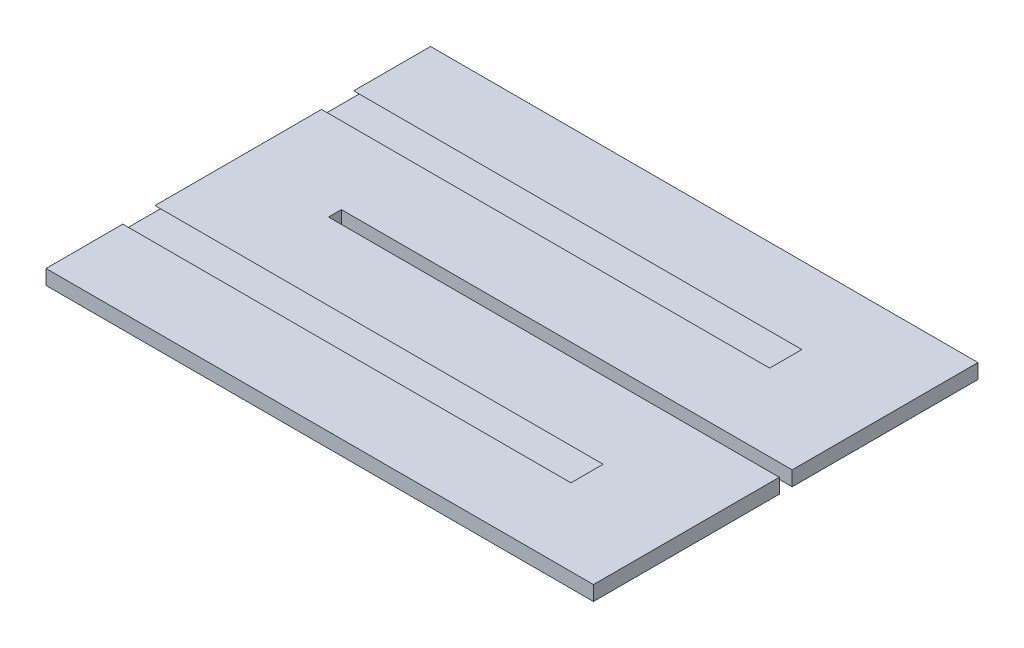
ISO-10303-21;
HEADER;
FILE_DESCRIPTION(('STEP AP214'),'2;1');
FILE_NAME('part.step','',(''),(''),'','','');
FILE_SCHEMA(('AUTOMOTIVE_DESIGN { 1 0 10303 214 1 1 1 1 }'));
ENDSEC;
DATA;
#1=APPLICATION_CONTEXT('core data for automotive mechanical design processes');
#2=APPLICATION_PROTOCOL_DEFINITION('international standard','automotive_design',2000,#1);
#3=PRODUCT_CONTEXT('',#1,'mechanical');
#4=PRODUCT('Part','Part','',(#3));
#5=PRODUCT_RELATED_PRODUCT_CATEGORY('part','',(#4));
#6=PRODUCT_DEFINITION_FORMATION('','',#4);
#7=PRODUCT_DEFINITION_CONTEXT('part definition',#1,'design');
#8=PRODUCT_DEFINITION('design','',#6,#7);
#9=PRODUCT_DEFINITION_SHAPE('','',#8);
#10=(LENGTH_UNIT() NAMED_UNIT(*) SI_UNIT(.MILLI.,.METRE.));
#11=(NAMED_UNIT(*) PLANE_ANGLE_UNIT() SI_UNIT($,.RADIAN.));
#12=(NAMED_UNIT(*) SI_UNIT($,.STERADIAN.) SOLID_ANGLE_UNIT());
#13=UNCERTAINTY_MEASURE_WITH_UNIT(LENGTH_MEASURE(1.E-05),#10,'distance_accuracy_value','');
#14=(GEOMETRIC_REPRESENTATION_CONTEXT(3) GLOBAL_UNCERTAINTY_ASSIGNED_CONTEXT((#13)) GLOBAL_UNIT_ASSIGNED_CONTEXT((#10,
#11,#12)) REPRESENTATION_CONTEXT('',''));
#15=CARTESIAN_POINT('',(0.,0.,0.));
#16=DIRECTION('',(0.,0.,1.));
#17=DIRECTION('',(1.,0.,0.));
#18=AXIS2_PLACEMENT_3D('',#15,#16,#17);
#19=CARTESIAN_POINT('',(0.,0.8,0.349999999999999));
#20=DIRECTION('',(0.,0.,1.));
#21=DIRECTION('',(1.,0.,0.));
#22=AXIS2_PLACEMENT_3D('',#19,#20,#21);
#23=PLANE('',#22);
#24=DIRECTION('',(-1.,0.,0.));
#25=VECTOR('',#24,1.);
#26=CARTESIAN_POINT('',(0.,0.,0.349999999999999));
#27=LINE('',#26,#25);
#28=CARTESIAN_POINT('',(16.2782407407407,0.,0.349999999999999));
#29=VERTEX_POINT('',#28);
#30=CARTESIAN_POINT('',(-8.22175925925925,0.,0.35));
#31=VERTEX_POINT('',#30);
#32=EDGE_CURVE('E314',#29,#31,#27,.T.);
#33=ORIENTED_EDGE('',*,*,#32,.T.);
#34=DIRECTION('',(0.,-1.,0.));
#35=VECTOR('',#34,1.);
#36=CARTESIAN_POINT('',(-8.22175925925925,0.8,0.35));
#37=LINE('',#36,#35);
#38=CARTESIAN_POINT('',(-8.22175925925925,0.8,0.35));
#39=VERTEX_POINT('',#38);
#40=EDGE_CURVE('E349',#39,#31,#37,.T.);
#41=ORIENTED_EDGE('',*,*,#40,.F.);
#42=DIRECTION('',(-1.,0.,0.));
#43=VECTOR('',#42,1.);
#44=CARTESIAN_POINT('',(0.,0.8,0.349999999999999));
#45=LINE('',#44,#43);
#46=CARTESIAN_POINT('',(16.2782407407407,0.8,0.349999999999999));
#47=VERTEX_POINT('',#46);
#48=EDGE_CURVE('E315',#47,#39,#45,.T.);
#49=ORIENTED_EDGE('',*,*,#48,.F.);
#50=DIRECTION('',(0.,1.,0.));
#51=VECTOR('',#50,1.);
#52=CARTESIAN_POINT('',(16.2782407407407,0.8,0.349999999999999));
#53=LINE('',#52,#51);
#54=EDGE_CURVE('E232',#29,#47,#53,.T.);
#55=ORIENTED_EDGE('',*,*,#54,.F.);
#56=EDGE_LOOP('',(#33,#41,#49,#55));
#57=FACE_BOUND('',#56,.T.);
#58=ADVANCED_FACE('F34',(#57),#23,.F.);
#59=CARTESIAN_POINT('',(-8.22175925925925,0.8,0.));
#60=DIRECTION('',(-1.,0.,0.));
#61=DIRECTION('',(0.,0.,1.));
#62=AXIS2_PLACEMENT_3D('',#59,#60,#61);
#63=PLANE('',#62);
#64=DIRECTION('',(0.,0.,-1.));
#65=VECTOR('',#64,1.);
#66=CARTESIAN_POINT('',(-8.22175925925925,0.,0.));
#67=LINE('',#66,#65);
#68=CARTESIAN_POINT('',(-8.22175925925925,0.,-0.35));
#69=VERTEX_POINT('',#68);
#70=EDGE_CURVE('E335',#31,#69,#67,.T.);
#71=ORIENTED_EDGE('',*,*,#70,.T.);
#72=DIRECTION('',(0.,-1.,0.));
#73=VECTOR('',#72,1.);
#74=CARTESIAN_POINT('',(-8.22175925925925,0.8,-0.35));
#75=LINE('',#74,#73);
#76=CARTESIAN_POINT('',(-8.22175925925925,0.8,-0.35));
#77=VERTEX_POINT('',#76);
#78=EDGE_CURVE('E347',#77,#69,#75,.T.);
#79=ORIENTED_EDGE('',*,*,#78,.F.);
#80=DIRECTION('',(0.,0.,-1.));
#81=VECTOR('',#80,1.);
#82=CARTESIAN_POINT('',(-8.22175925925925,0.8,0.));
#83=LINE('',#82,#81);
#84=EDGE_CURVE('E318',#39,#77,#83,.T.);
#85=ORIENTED_EDGE('',*,*,#84,.F.);
#86=ORIENTED_EDGE('',*,*,#40,.T.);
#87=EDGE_LOOP('',(#71,#79,#85,#86));
#88=FACE_BOUND('',#87,.T.);
#89=ADVANCED_FACE('F413',(#88),#63,.F.);
#90=CARTESIAN_POINT('',(0.,0.8,-0.349999999999999));
#91=DIRECTION('',(0.,0.,1.));
#92=DIRECTION('',(1.,0.,0.));
#93=AXIS2_PLACEMENT_3D('',#90,#91,#92);
#94=PLANE('',#93);
#95=DIRECTION('',(-1.,0.,0.));
#96=VECTOR('',#95,1.);
#97=CARTESIAN_POINT('',(0.,0.,-0.349999999999999));
#98=LINE('',#97,#96);
#99=CARTESIAN_POINT('',(16.2782407407407,0.,-0.349999999999999));
#100=VERTEX_POINT('',#99);
#101=EDGE_CURVE('E209',#100,#69,#98,.T.);
#102=ORIENTED_EDGE('',*,*,#101,.F.);
#103=DIRECTION('',(0.,-1.,0.));
#104=VECTOR('',#103,1.);
#105=CARTESIAN_POINT('',(16.2782407407407,0.,-0.349999999999999));
#106=LINE('',#105,#104);
#107=CARTESIAN_POINT('',(16.2782407407407,0.8,-0.349999999999999));
#108=VERTEX_POINT('',#107);
#109=EDGE_CURVE('E224',#108,#100,#106,.T.);
#110=ORIENTED_EDGE('',*,*,#109,.F.);
#111=DIRECTION('',(-1.,0.,0.));
#112=VECTOR('',#111,1.);
#113=CARTESIAN_POINT('',(0.,0.8,-0.349999999999999));
#114=LINE('',#113,#112);
#115=EDGE_CURVE('E321',#108,#77,#114,.T.);
#116=ORIENTED_EDGE('',*,*,#115,.T.);
#117=ORIENTED_EDGE('',*,*,#78,.T.);
#118=EDGE_LOOP('',(#102,#110,#116,#117));
#119=FACE_BOUND('',#118,.T.);
#120=ADVANCED_FACE('F418',(#119),#94,.T.);
#121=CARTESIAN_POINT('',(0.,0.8,-10.45));
#122=DIRECTION('',(0.,0.,-1.));
#123=DIRECTION('',(-1.,0.,0.));
#124=AXIS2_PLACEMENT_3D('',#121,#122,#123);
#125=PLANE('',#124);
#126=DIRECTION('',(1.,0.,0.));
#127=VECTOR('',#126,1.);
#128=CARTESIAN_POINT('',(0.,0.,-10.45));
#129=LINE('',#128,#127);
#130=CARTESIAN_POINT('',(-13.4782407407407,0.,-10.45));
#131=VERTEX_POINT('',#130);
#132=CARTESIAN_POINT('',(16.2782407407407,0.,-10.45));
#133=VERTEX_POINT('',#132);
#134=EDGE_CURVE('E196',#131,#133,#129,.T.);
#135=ORIENTED_EDGE('',*,*,#134,.F.);
#136=DIRECTION('',(0.,-1.,0.));
#137=VECTOR('',#136,1.);
#138=CARTESIAN_POINT('',(-13.4782407407407,0.8,-10.45));
#139=LINE('',#138,#137);
#140=CARTESIAN_POINT('',(-13.4782407407407,0.8,-10.45));
#141=VERTEX_POINT('',#140);
#142=EDGE_CURVE('E345',#141,#131,#139,.T.);
#143=ORIENTED_EDGE('',*,*,#142,.F.);
#144=DIRECTION('',(1.,0.,0.));
#145=VECTOR('',#144,1.);
#146=CARTESIAN_POINT('',(0.,0.8,-10.45));
#147=LINE('',#146,#145);
#148=CARTESIAN_POINT('',(16.2782407407407,0.8,-10.45));
#149=VERTEX_POINT('',#148);
#150=EDGE_CURVE('E215',#141,#149,#147,.T.);
#151=ORIENTED_EDGE('',*,*,#150,.T.);
#152=DIRECTION('',(0.,1.,0.));
#153=VECTOR('',#152,1.);
#154=CARTESIAN_POINT('',(16.2782407407407,0.8,-10.45));
#155=LINE('',#154,#153);
#156=EDGE_CURVE('E212',#133,#149,#155,.T.);
#157=ORIENTED_EDGE('',*,*,#156,.F.);
#158=EDGE_LOOP('',(#135,#143,#151,#157));
#159=FACE_BOUND('',#158,.T.);
#160=ADVANCED_FACE('F213',(#159),#125,.T.);
#161=CARTESIAN_POINT('',(-13.4782407407407,0.8,0.));
#162=DIRECTION('',(-1.,0.,0.));
#163=DIRECTION('',(0.,0.,1.));
#164=AXIS2_PLACEMENT_3D('',#161,#162,#163);
#165=PLANE('',#164);
#166=DIRECTION('',(0.,0.371390676354107,-0.928476690885258));
#167=VECTOR('',#166,1.);
#168=CARTESIAN_POINT('',(-13.4782407407407,-0.760344827586219,-0.624137931034494));
#169=LINE('',#168,#167);
#170=CARTESIAN_POINT('',(-13.4782407407407,0.5,-3.77500000000001));
#171=VERTEX_POINT('',#170);
#172=CARTESIAN_POINT('',(-13.4782407407407,0.8,-4.525));
#173=VERTEX_POINT('',#172);
#174=EDGE_CURVE('E312',#171,#173,#169,.T.);
#175=ORIENTED_EDGE('',*,*,#174,.F.);
#176=DIRECTION('',(0.,0.,1.));
#177=VECTOR('',#176,1.);
#178=CARTESIAN_POINT('',(-13.4782407407407,0.500000000000001,0.));
#179=LINE('',#178,#177);
#180=CARTESIAN_POINT('',(-13.4782407407407,0.5,-7.02499999999999));
#181=VERTEX_POINT('',#180);
#182=EDGE_CURVE('E11',#181,#171,#179,.T.);
#183=ORIENTED_EDGE('',*,*,#182,.F.);
#184=DIRECTION('',(0.,-0.371390676354114,-0.928476690885255));
#185=VECTOR('',#184,1.);
#186=CARTESIAN_POINT('',(-13.4782407407407,2.96379310344833,-0.865517241379358));
#187=LINE('',#186,#185);
#188=CARTESIAN_POINT('',(-13.4782407407407,0.800000000000006,-6.275));
#189=VERTEX_POINT('',#188);
#190=EDGE_CURVE('E310',#189,#181,#187,.T.);
#191=ORIENTED_EDGE('',*,*,#190,.F.);
#192=DIRECTION('',(0.,0.,-1.));
#193=VECTOR('',#192,1.);
#194=CARTESIAN_POINT('',(-13.4782407407407,0.8,0.));
#195=LINE('',#194,#193);
#196=EDGE_CURVE('E325',#189,#141,#195,.T.);
#197=ORIENTED_EDGE('',*,*,#196,.T.);
#198=ORIENTED_EDGE('',*,*,#142,.T.);
#199=DIRECTION('',(0.,0.,-1.));
#200=VECTOR('',#199,1.);
#201=CARTESIAN_POINT('',(-13.4782407407407,0.,0.));
#202=LINE('',#201,#200);
#203=CARTESIAN_POINT('',(-13.4782407407407,0.,-6.275));
#204=VERTEX_POINT('',#203);
#205=EDGE_CURVE('E205',#204,#131,#202,.T.);
#206=ORIENTED_EDGE('',*,*,#205,.F.);
#207=DIRECTION('',(0.,-0.371390676354114,0.928476690885255));
#208=VECTOR('',#207,1.);
#209=CARTESIAN_POINT('',(-13.4782407407407,-2.05344827586212,-1.14137931034488));
#210=LINE('',#209,#208);
#211=CARTESIAN_POINT('',(-13.4782407407407,0.3,-7.02499999999999));
#212=VERTEX_POINT('',#211);
#213=EDGE_CURVE('E304',#212,#204,#210,.T.);
#214=ORIENTED_EDGE('',*,*,#213,.F.);
#215=DIRECTION('',(0.,0.,-1.));
#216=VECTOR('',#215,1.);
#217=CARTESIAN_POINT('',(-13.4782407407407,0.299999999999999,0.));
#218=LINE('',#217,#216);
#219=CARTESIAN_POINT('',(-13.4782407407407,0.3,-3.77500000000001));
#220=VERTEX_POINT('',#219);
#221=EDGE_CURVE('E41',#220,#212,#218,.T.);
#222=ORIENTED_EDGE('',*,*,#221,.F.);
#223=DIRECTION('',(0.,0.371390676354107,0.928476690885258));
#224=VECTOR('',#223,1.);
#225=CARTESIAN_POINT('',(-13.4782407407407,1.67068965517243,-0.348275862068975));
#226=LINE('',#225,#224);
#227=CARTESIAN_POINT('',(-13.4782407407407,0.,-4.525));
#228=VERTEX_POINT('',#227);
#229=EDGE_CURVE('E302',#228,#220,#226,.T.);
#230=ORIENTED_EDGE('',*,*,#229,.F.);
#231=CARTESIAN_POINT('',(-13.4782407407407,0.,4.525));
#232=VERTEX_POINT('',#231);
#233=EDGE_CURVE('E342',#232,#228,#202,.T.);
#234=ORIENTED_EDGE('',*,*,#233,.F.);
#235=DIRECTION('',(0.,-0.371390676354107,0.928476690885258));
#236=VECTOR('',#235,1.);
#237=CARTESIAN_POINT('',(-13.4782407407407,1.67068965517243,0.348275862068975));
#238=LINE('',#237,#236);
#239=CARTESIAN_POINT('',(-13.4782407407407,0.3,3.77500000000001));
#240=VERTEX_POINT('',#239);
#241=EDGE_CURVE('E300',#240,#232,#238,.T.);
#242=ORIENTED_EDGE('',*,*,#241,.F.);
#243=DIRECTION('',(0.,0.,-1.));
#244=VECTOR('',#243,1.);
#245=CARTESIAN_POINT('',(-13.4782407407407,0.299999999999999,0.));
#246=LINE('',#245,#244);
#247=CARTESIAN_POINT('',(-13.4782407407407,0.3,7.02499999999999));
#248=VERTEX_POINT('',#247);
#249=EDGE_CURVE('E373',#248,#240,#246,.T.);
#250=ORIENTED_EDGE('',*,*,#249,.F.);
#251=DIRECTION('',(0.,0.371390676354114,0.928476690885255));
#252=VECTOR('',#251,1.);
#253=CARTESIAN_POINT('',(-13.4782407407407,-2.05344827586212,1.14137931034488));
#254=LINE('',#253,#252);
#255=CARTESIAN_POINT('',(-13.4782407407407,0.,6.275));
#256=VERTEX_POINT('',#255);
#257=EDGE_CURVE('E297',#256,#248,#254,.T.);
#258=ORIENTED_EDGE('',*,*,#257,.F.);
#259=CARTESIAN_POINT('',(-13.4782407407407,0.,10.45));
#260=VERTEX_POINT('',#259);
#261=EDGE_CURVE('E339',#260,#256,#202,.T.);
#262=ORIENTED_EDGE('',*,*,#261,.F.);
#263=DIRECTION('',(0.,-1.,0.));
#264=VECTOR('',#263,1.);
#265=CARTESIAN_POINT('',(-13.4782407407407,0.8,10.45));
#266=LINE('',#265,#264);
#267=CARTESIAN_POINT('',(-13.4782407407407,0.8,10.45));
#268=VERTEX_POINT('',#267);
#269=EDGE_CURVE('E332',#268,#260,#266,.T.);
#270=ORIENTED_EDGE('',*,*,#269,.F.);
#271=CARTESIAN_POINT('',(-13.4782407407407,0.800000000000006,6.275));
#272=VERTEX_POINT('',#271);
#273=EDGE_CURVE('E326',#268,#272,#195,.T.);
#274=ORIENTED_EDGE('',*,*,#273,.T.);
#275=DIRECTION('',(0.,0.371390676354114,-0.928476690885255));
#276=VECTOR('',#275,1.);
#277=CARTESIAN_POINT('',(-13.4782407407407,2.96379310344833,0.865517241379358));
#278=LINE('',#277,#276);
#279=CARTESIAN_POINT('',(-13.4782407407407,0.5,7.02499999999999));
#280=VERTEX_POINT('',#279);
#281=EDGE_CURVE('E308',#280,#272,#278,.T.);
#282=ORIENTED_EDGE('',*,*,#281,.F.);
#283=DIRECTION('',(0.,0.,1.));
#284=VECTOR('',#283,1.);
#285=CARTESIAN_POINT('',(-13.4782407407407,0.500000000000001,0.));
#286=LINE('',#285,#284);
#287=CARTESIAN_POINT('',(-13.4782407407407,0.5,3.77500000000001));
#288=VERTEX_POINT('',#287);
#289=EDGE_CURVE('E371',#288,#280,#286,.T.);
#290=ORIENTED_EDGE('',*,*,#289,.F.);
#291=DIRECTION('',(0.,-0.371390676354107,-0.928476690885258));
#292=VECTOR('',#291,1.);
#293=CARTESIAN_POINT('',(-13.4782407407407,-0.760344827586219,0.624137931034494));
#294=LINE('',#293,#292);
#295=CARTESIAN_POINT('',(-13.4782407407407,0.8,4.525));
#296=VERTEX_POINT('',#295);
#297=EDGE_CURVE('E306',#296,#288,#294,.T.);
#298=ORIENTED_EDGE('',*,*,#297,.F.);
#299=EDGE_CURVE('E330',#296,#173,#195,.T.);
#300=ORIENTED_EDGE('',*,*,#299,.T.);
#301=EDGE_LOOP('',(#175,#183,#191,#197,#198,#206,#214,#222,#230,#234,#242,#250,#258,#262,#270,
#274,#282,#290,#298,#300));
#302=FACE_BOUND('',#301,.T.);
#303=ADVANCED_FACE('F387',(#302),#165,.T.);
#304=CARTESIAN_POINT('',(0.,0.8,10.45));
#305=DIRECTION('',(0.,0.,-1.));
#306=DIRECTION('',(-1.,0.,0.));
#307=AXIS2_PLACEMENT_3D('',#304,#305,#306);
#308=PLANE('',#307);
#309=DIRECTION('',(1.,0.,0.));
#310=VECTOR('',#309,1.);
#311=CARTESIAN_POINT('',(0.,0.,10.45));
#312=LINE('',#311,#310);
#313=CARTESIAN_POINT('',(16.2782407407407,0.,10.45));
#314=VERTEX_POINT('',#313);
#315=EDGE_CURVE('E319',#260,#314,#312,.T.);
#316=ORIENTED_EDGE('',*,*,#315,.T.);
#317=DIRECTION('',(0.,-1.,0.));
#318=VECTOR('',#317,1.);
#319=CARTESIAN_POINT('',(16.2782407407407,0.,10.45));
#320=LINE('',#319,#318);
#321=CARTESIAN_POINT('',(16.2782407407407,0.8,10.45));
#322=VERTEX_POINT('',#321);
#323=EDGE_CURVE('E238',#322,#314,#320,.T.);
#324=ORIENTED_EDGE('',*,*,#323,.F.);
#325=DIRECTION('',(1.,0.,0.));
#326=VECTOR('',#325,1.);
#327=CARTESIAN_POINT('',(0.,0.8,10.45));
#328=LINE('',#327,#326);
#329=EDGE_CURVE('E329',#268,#322,#328,.T.);
#330=ORIENTED_EDGE('',*,*,#329,.F.);
#331=ORIENTED_EDGE('',*,*,#269,.T.);
#332=EDGE_LOOP('',(#316,#324,#330,#331));
#333=FACE_BOUND('',#332,.T.);
#334=ADVANCED_FACE('F434',(#333),#308,.F.);
#335=CARTESIAN_POINT('',(0.,0.8,0.));
#336=DIRECTION('',(0.,1.,0.));
#337=DIRECTION('',(0.,0.,1.));
#338=AXIS2_PLACEMENT_3D('',#335,#336,#337);
#339=PLANE('',#338);
#340=DIRECTION('',(1.,0.,0.));
#341=VECTOR('',#340,1.);
#342=CARTESIAN_POINT('',(0.,0.8,-4.525));
#343=LINE('',#342,#341);
#344=CARTESIAN_POINT('',(10.8782407407407,0.8,-4.525));
#345=VERTEX_POINT('',#344);
#346=EDGE_CURVE('E369',#173,#345,#343,.T.);
#347=ORIENTED_EDGE('',*,*,#346,.F.);
#348=ORIENTED_EDGE('',*,*,#299,.F.);
#349=DIRECTION('',(-1.,0.,0.));
#350=VECTOR('',#349,1.);
#351=CARTESIAN_POINT('',(0.,0.8,4.525));
#352=LINE('',#351,#350);
#353=CARTESIAN_POINT('',(10.8782407407407,0.8,4.525));
#354=VERTEX_POINT('',#353);
#355=EDGE_CURVE('E363',#354,#296,#352,.T.);
#356=ORIENTED_EDGE('',*,*,#355,.F.);
#357=DIRECTION('',(0.,0.,1.));
#358=VECTOR('',#357,1.);
#359=CARTESIAN_POINT('',(10.8782407407407,0.800000000000006,6.275));
#360=LINE('',#359,#358);
#361=CARTESIAN_POINT('',(10.8782407407407,0.8,6.27500000000001));
#362=VERTEX_POINT('',#361);
#363=EDGE_CURVE('E291',#354,#362,#360,.T.);
#364=ORIENTED_EDGE('',*,*,#363,.T.);
#365=DIRECTION('',(1.,0.,0.));
#366=VECTOR('',#365,1.);
#367=CARTESIAN_POINT('',(0.,0.8,6.27500000000001));
#368=LINE('',#367,#366);
#369=EDGE_CURVE('E365',#272,#362,#368,.T.);
#370=ORIENTED_EDGE('',*,*,#369,.F.);
#371=ORIENTED_EDGE('',*,*,#273,.F.);
#372=ORIENTED_EDGE('',*,*,#329,.T.);
#373=DIRECTION('',(0.,0.,1.));
#374=VECTOR('',#373,1.);
#375=CARTESIAN_POINT('',(16.2782407407407,0.8,10.45));
#376=LINE('',#375,#374);
#377=EDGE_CURVE('E235',#47,#322,#376,.T.);
#378=ORIENTED_EDGE('',*,*,#377,.F.);
#379=ORIENTED_EDGE('',*,*,#48,.T.);
#380=ORIENTED_EDGE('',*,*,#84,.T.);
#381=ORIENTED_EDGE('',*,*,#115,.F.);
#382=DIRECTION('',(0.,0.,1.));
#383=VECTOR('',#382,1.);
#384=CARTESIAN_POINT('',(16.2782407407407,0.8,-0.349999999999999));
#385=LINE('',#384,#383);
#386=EDGE_CURVE('E219',#149,#108,#385,.T.);
#387=ORIENTED_EDGE('',*,*,#386,.F.);
#388=ORIENTED_EDGE('',*,*,#150,.F.);
#389=ORIENTED_EDGE('',*,*,#196,.F.);
#390=DIRECTION('',(-1.,0.,0.));
#391=VECTOR('',#390,1.);
#392=CARTESIAN_POINT('',(0.,0.8,-6.27500000000001));
#393=LINE('',#392,#391);
#394=CARTESIAN_POINT('',(10.8782407407407,0.800000000000006,-6.275));
#395=VERTEX_POINT('',#394);
#396=EDGE_CURVE('E367',#395,#189,#393,.T.);
#397=ORIENTED_EDGE('',*,*,#396,.F.);
#398=DIRECTION('',(0.,0.,1.));
#399=VECTOR('',#398,1.);
#400=CARTESIAN_POINT('',(10.8782407407407,0.800000000000006,-6.275));
#401=LINE('',#400,#399);
#402=EDGE_CURVE('E278',#395,#345,#401,.T.);
#403=ORIENTED_EDGE('',*,*,#402,.T.);
#404=EDGE_LOOP('',(#347,#348,#356,#364,#370,#371,#372,#378,#379,#380,#381,#387,#388,#389,#397,#403));
#405=FACE_BOUND('',#404,.T.);
#406=ADVANCED_FACE('F428',(#405),#339,.T.);
#407=CARTESIAN_POINT('',(0.,0.,0.));
#408=DIRECTION('',(0.,1.,0.));
#409=DIRECTION('',(0.,0.,1.));
#410=AXIS2_PLACEMENT_3D('',#407,#408,#409);
#411=PLANE('',#410);
#412=DIRECTION('',(0.,0.,-1.));
#413=VECTOR('',#412,1.);
#414=CARTESIAN_POINT('',(10.8782407407407,0.,-6.275));
#415=LINE('',#414,#413);
#416=CARTESIAN_POINT('',(10.8782407407407,0.,-4.525));
#417=VERTEX_POINT('',#416);
#418=CARTESIAN_POINT('',(10.8782407407407,0.,-6.27500000000001));
#419=VERTEX_POINT('',#418);
#420=EDGE_CURVE('E268',#417,#419,#415,.T.);
#421=ORIENTED_EDGE('',*,*,#420,.T.);
#422=DIRECTION('',(-1.,0.,0.));
#423=VECTOR('',#422,1.);
#424=CARTESIAN_POINT('',(0.,0.,-6.27500000000001));
#425=LINE('',#424,#423);
#426=EDGE_CURVE('E361',#419,#204,#425,.T.);
#427=ORIENTED_EDGE('',*,*,#426,.T.);
#428=ORIENTED_EDGE('',*,*,#205,.T.);
#429=ORIENTED_EDGE('',*,*,#134,.T.);
#430=DIRECTION('',(0.,0.,-1.));
#431=VECTOR('',#430,1.);
#432=CARTESIAN_POINT('',(16.2782407407407,0.,-10.45));
#433=LINE('',#432,#431);
#434=EDGE_CURVE('E202',#100,#133,#433,.T.);
#435=ORIENTED_EDGE('',*,*,#434,.F.);
#436=ORIENTED_EDGE('',*,*,#101,.T.);
#437=ORIENTED_EDGE('',*,*,#70,.F.);
#438=ORIENTED_EDGE('',*,*,#32,.F.);
#439=DIRECTION('',(0.,0.,-1.));
#440=VECTOR('',#439,1.);
#441=CARTESIAN_POINT('',(16.2782407407407,0.,0.349999999999999));
#442=LINE('',#441,#440);
#443=EDGE_CURVE('E229',#314,#29,#442,.T.);
#444=ORIENTED_EDGE('',*,*,#443,.F.);
#445=ORIENTED_EDGE('',*,*,#315,.F.);
#446=ORIENTED_EDGE('',*,*,#261,.T.);
#447=DIRECTION('',(1.,0.,0.));
#448=VECTOR('',#447,1.);
#449=CARTESIAN_POINT('',(0.,0.,6.27500000000001));
#450=LINE('',#449,#448);
#451=CARTESIAN_POINT('',(10.8782407407407,0.,6.275));
#452=VERTEX_POINT('',#451);
#453=EDGE_CURVE('E352',#256,#452,#450,.T.);
#454=ORIENTED_EDGE('',*,*,#453,.T.);
#455=DIRECTION('',(0.,0.,-1.));
#456=VECTOR('',#455,1.);
#457=CARTESIAN_POINT('',(10.8782407407407,0.,6.275));
#458=LINE('',#457,#456);
#459=CARTESIAN_POINT('',(10.8782407407407,0.,4.525));
#460=VERTEX_POINT('',#459);
#461=EDGE_CURVE('E249',#452,#460,#458,.T.);
#462=ORIENTED_EDGE('',*,*,#461,.T.);
#463=DIRECTION('',(-1.,0.,0.));
#464=VECTOR('',#463,1.);
#465=CARTESIAN_POINT('',(0.,0.,4.525));
#466=LINE('',#465,#464);
#467=EDGE_CURVE('E355',#460,#232,#466,.T.);
#468=ORIENTED_EDGE('',*,*,#467,.T.);
#469=ORIENTED_EDGE('',*,*,#233,.T.);
#470=DIRECTION('',(1.,0.,0.));
#471=VECTOR('',#470,1.);
#472=CARTESIAN_POINT('',(0.,0.,-4.525));
#473=LINE('',#472,#471);
#474=EDGE_CURVE('E358',#228,#417,#473,.T.);
#475=ORIENTED_EDGE('',*,*,#474,.T.);
#476=EDGE_LOOP('',(#421,#427,#428,#429,#435,#436,#437,#438,#444,#445,#446,#454,#462,#468,#469,#475));
#477=FACE_BOUND('',#476,.T.);
#478=ADVANCED_FACE('F199',(#477),#411,.F.);
#479=CARTESIAN_POINT('',(-13.6217592592593,0.3,7.02499999999999));
#480=DIRECTION('',(0.,1.,0.));
#481=DIRECTION('',(0.,0.,1.));
#482=AXIS2_PLACEMENT_3D('',#479,#480,#481);
#483=PLANE('',#482);
#484=ORIENTED_EDGE('',*,*,#249,.T.);
#485=DIRECTION('',(1.,0.,0.));
#486=VECTOR('',#485,1.);
#487=CARTESIAN_POINT('',(-13.6217592592593,0.3,3.77500000000001));
#488=LINE('',#487,#486);
#489=CARTESIAN_POINT('',(10.8782407407407,0.3,3.77500000000001));
#490=VERTEX_POINT('',#489);
#491=EDGE_CURVE('E256',#240,#490,#488,.T.);
#492=ORIENTED_EDGE('',*,*,#491,.T.);
#493=DIRECTION('',(0.,0.,1.));
#494=VECTOR('',#493,1.);
#495=CARTESIAN_POINT('',(10.8782407407407,0.3,7.02499999999999));
#496=LINE('',#495,#494);
#497=CARTESIAN_POINT('',(10.8782407407407,0.3,7.02499999999999));
#498=VERTEX_POINT('',#497);
#499=EDGE_CURVE('E242',#490,#498,#496,.T.);
#500=ORIENTED_EDGE('',*,*,#499,.T.);
#501=DIRECTION('',(1.,0.,0.));
#502=VECTOR('',#501,1.);
#503=CARTESIAN_POINT('',(-13.6217592592593,0.3,7.02499999999999));
#504=LINE('',#503,#502);
#505=EDGE_CURVE('E255',#248,#498,#504,.T.);
#506=ORIENTED_EDGE('',*,*,#505,.F.);
#507=EDGE_LOOP('',(#484,#492,#500,#506));
#508=FACE_BOUND('',#507,.T.);
#509=ADVANCED_FACE('F443',(#508),#483,.F.);
#510=CARTESIAN_POINT('',(-13.6217592592593,0.3,3.77500000000001));
#511=DIRECTION('',(0.,-0.928476690885258,-0.371390676354107));
#512=DIRECTION('',(0.,0.371390676354107,-0.928476690885258));
#513=AXIS2_PLACEMENT_3D('',#510,#511,#512);
#514=PLANE('',#513);
#515=ORIENTED_EDGE('',*,*,#241,.T.);
#516=ORIENTED_EDGE('',*,*,#467,.F.);
#517=DIRECTION('',(0.,0.371390676354107,-0.928476690885258));
#518=VECTOR('',#517,1.);
#519=CARTESIAN_POINT('',(10.8782407407407,0.3,3.77500000000001));
#520=LINE('',#519,#518);
#521=EDGE_CURVE('E252',#460,#490,#520,.T.);
#522=ORIENTED_EDGE('',*,*,#521,.T.);
#523=ORIENTED_EDGE('',*,*,#491,.F.);
#524=EDGE_LOOP('',(#515,#516,#522,#523));
#525=FACE_BOUND('',#524,.T.);
#526=ADVANCED_FACE('F449',(#525),#514,.F.);
#527=CARTESIAN_POINT('',(-13.6217592592593,0.3,7.02499999999999));
#528=DIRECTION('',(0.,-0.928476690885255,0.371390676354114));
#529=DIRECTION('',(0.,-0.371390676354114,-0.928476690885255));
#530=AXIS2_PLACEMENT_3D('',#527,#528,#529);
#531=PLANE('',#530);
#532=ORIENTED_EDGE('',*,*,#257,.T.);
#533=ORIENTED_EDGE('',*,*,#505,.T.);
#534=DIRECTION('',(0.,-0.371390676354114,-0.928476690885255));
#535=VECTOR('',#534,1.);
#536=CARTESIAN_POINT('',(10.8782407407407,0.3,7.02499999999999));
#537=LINE('',#536,#535);
#538=EDGE_CURVE('E245',#498,#452,#537,.T.);
#539=ORIENTED_EDGE('',*,*,#538,.T.);
#540=ORIENTED_EDGE('',*,*,#453,.F.);
#541=EDGE_LOOP('',(#532,#533,#539,#540));
#542=FACE_BOUND('',#541,.T.);
#543=ADVANCED_FACE('F440',(#542),#531,.F.);
#544=CARTESIAN_POINT('',(10.8782407407407,0.,0.));
#545=DIRECTION('',(-1.,0.,0.));
#546=DIRECTION('',(0.,0.,1.));
#547=AXIS2_PLACEMENT_3D('',#544,#545,#546);
#548=PLANE('',#547);
#549=ORIENTED_EDGE('',*,*,#499,.F.);
#550=ORIENTED_EDGE('',*,*,#521,.F.);
#551=ORIENTED_EDGE('',*,*,#461,.F.);
#552=ORIENTED_EDGE('',*,*,#538,.F.);
#553=EDGE_LOOP('',(#549,#550,#551,#552));
#554=FACE_BOUND('',#553,.T.);
#555=ADVANCED_FACE('F447',(#554),#548,.T.);
#556=CARTESIAN_POINT('',(-13.6217592592593,0.3,-7.02499999999999));
#557=DIRECTION('',(0.,-0.928476690885255,-0.371390676354114));
#558=DIRECTION('',(0.,0.371390676354114,-0.928476690885255));
#559=AXIS2_PLACEMENT_3D('',#556,#557,#558);
#560=PLANE('',#559);
#561=ORIENTED_EDGE('',*,*,#213,.T.);
#562=ORIENTED_EDGE('',*,*,#426,.F.);
#563=DIRECTION('',(0.,0.371390676354114,-0.928476690885255));
#564=VECTOR('',#563,1.);
#565=CARTESIAN_POINT('',(10.8782407407407,0.3,-7.02499999999999));
#566=LINE('',#565,#564);
#567=CARTESIAN_POINT('',(10.8782407407407,0.3,-7.02499999999999));
#568=VERTEX_POINT('',#567);
#569=EDGE_CURVE('E259',#419,#568,#566,.T.);
#570=ORIENTED_EDGE('',*,*,#569,.T.);
#571=DIRECTION('',(1.,0.,0.));
#572=VECTOR('',#571,1.);
#573=CARTESIAN_POINT('',(-13.6217592592593,0.3,-7.02499999999999));
#574=LINE('',#573,#572);
#575=EDGE_CURVE('E270',#212,#568,#574,.T.);
#576=ORIENTED_EDGE('',*,*,#575,.F.);
#577=EDGE_LOOP('',(#561,#562,#570,#576));
#578=FACE_BOUND('',#577,.T.);
#579=ADVANCED_FACE('F384',(#578),#560,.F.);
#580=CARTESIAN_POINT('',(-13.6217592592593,0.3,-3.77500000000001));
#581=DIRECTION('',(0.,-0.928476690885258,0.371390676354107));
#582=DIRECTION('',(0.,-0.371390676354107,-0.928476690885258));
#583=AXIS2_PLACEMENT_3D('',#580,#581,#582);
#584=PLANE('',#583);
#585=ORIENTED_EDGE('',*,*,#229,.T.);
#586=DIRECTION('',(1.,0.,0.));
#587=VECTOR('',#586,1.);
#588=CARTESIAN_POINT('',(-13.6217592592593,0.3,-3.77500000000001));
#589=LINE('',#588,#587);
#590=CARTESIAN_POINT('',(10.8782407407407,0.3,-3.77500000000001));
#591=VERTEX_POINT('',#590);
#592=EDGE_CURVE('E246',#220,#591,#589,.T.);
#593=ORIENTED_EDGE('',*,*,#592,.T.);
#594=DIRECTION('',(0.,-0.371390676354107,-0.928476690885258));
#595=VECTOR('',#594,1.);
#596=CARTESIAN_POINT('',(10.8782407407407,0.3,-3.77500000000001));
#597=LINE('',#596,#595);
#598=EDGE_CURVE('E266',#591,#417,#597,.T.);
#599=ORIENTED_EDGE('',*,*,#598,.T.);
#600=ORIENTED_EDGE('',*,*,#474,.F.);
#601=EDGE_LOOP('',(#585,#593,#599,#600));
#602=FACE_BOUND('',#601,.T.);
#603=ADVANCED_FACE('F394',(#602),#584,.F.);
#604=CARTESIAN_POINT('',(-13.6217592592593,0.3,-7.02499999999999));
#605=DIRECTION('',(0.,1.,0.));
#606=DIRECTION('',(0.,0.,1.));
#607=AXIS2_PLACEMENT_3D('',#604,#605,#606);
#608=PLANE('',#607);
#609=ORIENTED_EDGE('',*,*,#221,.T.);
#610=ORIENTED_EDGE('',*,*,#575,.T.);
#611=DIRECTION('',(0.,0.,1.));
#612=VECTOR('',#611,1.);
#613=CARTESIAN_POINT('',(10.8782407407407,0.3,-7.02499999999999));
#614=LINE('',#613,#612);
#615=EDGE_CURVE('E262',#568,#591,#614,.T.);
#616=ORIENTED_EDGE('',*,*,#615,.T.);
#617=ORIENTED_EDGE('',*,*,#592,.F.);
#618=EDGE_LOOP('',(#609,#610,#616,#617));
#619=FACE_BOUND('',#618,.T.);
#620=ADVANCED_FACE('F378',(#619),#608,.F.);
#621=CARTESIAN_POINT('',(10.8782407407407,0.,0.));
#622=DIRECTION('',(1.,0.,0.));
#623=DIRECTION('',(0.,0.,-1.));
#624=AXIS2_PLACEMENT_3D('',#621,#622,#623);
#625=PLANE('',#624);
#626=ORIENTED_EDGE('',*,*,#569,.F.);
#627=ORIENTED_EDGE('',*,*,#420,.F.);
#628=ORIENTED_EDGE('',*,*,#598,.F.);
#629=ORIENTED_EDGE('',*,*,#615,.F.);
#630=EDGE_LOOP('',(#626,#627,#628,#629));
#631=FACE_BOUND('',#630,.T.);
#632=ADVANCED_FACE('F398',(#631),#625,.F.);
#633=CARTESIAN_POINT('',(-13.6217592592593,0.5,7.02499999999999));
#634=DIRECTION('',(0.,0.928476690885255,0.371390676354114));
#635=DIRECTION('',(0.,-0.371390676354114,0.928476690885255));
#636=AXIS2_PLACEMENT_3D('',#633,#634,#635);
#637=PLANE('',#636);
#638=ORIENTED_EDGE('',*,*,#281,.T.);
#639=ORIENTED_EDGE('',*,*,#369,.T.);
#640=DIRECTION('',(0.,-0.371390676354114,0.928476690885255));
#641=VECTOR('',#640,1.);
#642=CARTESIAN_POINT('',(10.8782407407407,0.5,7.02499999999999));
#643=LINE('',#642,#641);
#644=CARTESIAN_POINT('',(10.8782407407407,0.5,7.02499999999999));
#645=VERTEX_POINT('',#644);
#646=EDGE_CURVE('E56',#362,#645,#643,.T.);
#647=ORIENTED_EDGE('',*,*,#646,.T.);
#648=DIRECTION('',(1.,0.,0.));
#649=VECTOR('',#648,1.);
#650=CARTESIAN_POINT('',(-13.6217592592593,0.5,7.02499999999999));
#651=LINE('',#650,#649);
#652=EDGE_CURVE('E294',#280,#645,#651,.T.);
#653=ORIENTED_EDGE('',*,*,#652,.F.);
#654=EDGE_LOOP('',(#638,#639,#647,#653));
#655=FACE_BOUND('',#654,.T.);
#656=ADVANCED_FACE('F400',(#655),#637,.F.);
#657=CARTESIAN_POINT('',(-13.6217592592593,0.5,3.77500000000001));
#658=DIRECTION('',(0.,0.928476690885258,-0.371390676354107));
#659=DIRECTION('',(0.,0.371390676354107,0.928476690885258));
#660=AXIS2_PLACEMENT_3D('',#657,#658,#659);
#661=PLANE('',#660);
#662=ORIENTED_EDGE('',*,*,#297,.T.);
#663=DIRECTION('',(1.,0.,0.));
#664=VECTOR('',#663,1.);
#665=CARTESIAN_POINT('',(-13.6217592592593,0.5,3.77500000000001));
#666=LINE('',#665,#664);
#667=CARTESIAN_POINT('',(10.8782407407407,0.5,3.77500000000001));
#668=VERTEX_POINT('',#667);
#669=EDGE_CURVE('E295',#288,#668,#666,.T.);
#670=ORIENTED_EDGE('',*,*,#669,.T.);
#671=DIRECTION('',(0.,0.371390676354107,0.928476690885258));
#672=VECTOR('',#671,1.);
#673=CARTESIAN_POINT('',(10.8782407407407,0.5,3.77500000000001));
#674=LINE('',#673,#672);
#675=EDGE_CURVE('E289',#668,#354,#674,.T.);
#676=ORIENTED_EDGE('',*,*,#675,.T.);
#677=ORIENTED_EDGE('',*,*,#355,.T.);
#678=EDGE_LOOP('',(#662,#670,#676,#677));
#679=FACE_BOUND('',#678,.T.);
#680=ADVANCED_FACE('F406',(#679),#661,.F.);
#681=CARTESIAN_POINT('',(-13.6217592592593,0.5,7.02499999999999));
#682=DIRECTION('',(0.,-1.,0.));
#683=DIRECTION('',(0.,0.,-1.));
#684=AXIS2_PLACEMENT_3D('',#681,#682,#683);
#685=PLANE('',#684);
#686=ORIENTED_EDGE('',*,*,#289,.T.);
#687=ORIENTED_EDGE('',*,*,#652,.T.);
#688=DIRECTION('',(0.,0.,-1.));
#689=VECTOR('',#688,1.);
#690=CARTESIAN_POINT('',(10.8782407407407,0.5,7.02499999999999));
#691=LINE('',#690,#689);
#692=EDGE_CURVE('E286',#645,#668,#691,.T.);
#693=ORIENTED_EDGE('',*,*,#692,.T.);
#694=ORIENTED_EDGE('',*,*,#669,.F.);
#695=EDGE_LOOP('',(#686,#687,#693,#694));
#696=FACE_BOUND('',#695,.T.);
#697=ADVANCED_FACE('F508',(#696),#685,.F.);
#698=CARTESIAN_POINT('',(10.8782407407407,0.,0.));
#699=DIRECTION('',(1.,0.,0.));
#700=DIRECTION('',(0.,0.,-1.));
#701=AXIS2_PLACEMENT_3D('',#698,#699,#700);
#702=PLANE('',#701);
#703=ORIENTED_EDGE('',*,*,#646,.F.);
#704=ORIENTED_EDGE('',*,*,#363,.F.);
#705=ORIENTED_EDGE('',*,*,#675,.F.);
#706=ORIENTED_EDGE('',*,*,#692,.F.);
#707=EDGE_LOOP('',(#703,#704,#705,#706));
#708=FACE_BOUND('',#707,.T.);
#709=ADVANCED_FACE('F500',(#708),#702,.F.);
#710=CARTESIAN_POINT('',(-13.6217592592593,0.5,-7.02499999999999));
#711=DIRECTION('',(0.,-1.,0.));
#712=DIRECTION('',(0.,0.,-1.));
#713=AXIS2_PLACEMENT_3D('',#710,#711,#712);
#714=PLANE('',#713);
#715=ORIENTED_EDGE('',*,*,#182,.T.);
#716=DIRECTION('',(1.,0.,0.));
#717=VECTOR('',#716,1.);
#718=CARTESIAN_POINT('',(-13.6217592592593,0.5,-3.77500000000001));
#719=LINE('',#718,#717);
#720=CARTESIAN_POINT('',(10.8782407407407,0.5,-3.77500000000001));
#721=VERTEX_POINT('',#720);
#722=EDGE_CURVE('E263',#171,#721,#719,.T.);
#723=ORIENTED_EDGE('',*,*,#722,.T.);
#724=DIRECTION('',(0.,0.,-1.));
#725=VECTOR('',#724,1.);
#726=CARTESIAN_POINT('',(10.8782407407407,0.5,-7.02499999999999));
#727=LINE('',#726,#725);
#728=CARTESIAN_POINT('',(10.8782407407407,0.5,-7.02499999999999));
#729=VERTEX_POINT('',#728);
#730=EDGE_CURVE('E241',#721,#729,#727,.T.);
#731=ORIENTED_EDGE('',*,*,#730,.T.);
#732=DIRECTION('',(1.,0.,0.));
#733=VECTOR('',#732,1.);
#734=CARTESIAN_POINT('',(-13.6217592592593,0.5,-7.02499999999999));
#735=LINE('',#734,#733);
#736=EDGE_CURVE('E282',#181,#729,#735,.T.);
#737=ORIENTED_EDGE('',*,*,#736,.F.);
#738=EDGE_LOOP('',(#715,#723,#731,#737));
#739=FACE_BOUND('',#738,.T.);
#740=ADVANCED_FACE('F492',(#739),#714,.F.);
#741=CARTESIAN_POINT('',(-13.6217592592593,0.5,-3.77500000000001));
#742=DIRECTION('',(0.,0.928476690885258,0.371390676354107));
#743=DIRECTION('',(0.,-0.371390676354107,0.928476690885258));
#744=AXIS2_PLACEMENT_3D('',#741,#742,#743);
#745=PLANE('',#744);
#746=ORIENTED_EDGE('',*,*,#174,.T.);
#747=ORIENTED_EDGE('',*,*,#346,.T.);
#748=DIRECTION('',(0.,-0.371390676354107,0.928476690885258));
#749=VECTOR('',#748,1.);
#750=CARTESIAN_POINT('',(10.8782407407407,0.5,-3.77500000000001));
#751=LINE('',#750,#749);
#752=EDGE_CURVE('E48',#345,#721,#751,.T.);
#753=ORIENTED_EDGE('',*,*,#752,.T.);
#754=ORIENTED_EDGE('',*,*,#722,.F.);
#755=EDGE_LOOP('',(#746,#747,#753,#754));
#756=FACE_BOUND('',#755,.T.);
#757=ADVANCED_FACE('F484',(#756),#745,.F.);
#758=CARTESIAN_POINT('',(-13.6217592592593,0.5,-7.02499999999999));
#759=DIRECTION('',(0.,0.928476690885255,-0.371390676354114));
#760=DIRECTION('',(0.,0.371390676354114,0.928476690885255));
#761=AXIS2_PLACEMENT_3D('',#758,#759,#760);
#762=PLANE('',#761);
#763=ORIENTED_EDGE('',*,*,#190,.T.);
#764=ORIENTED_EDGE('',*,*,#736,.T.);
#765=DIRECTION('',(0.,0.371390676354114,0.928476690885255));
#766=VECTOR('',#765,1.);
#767=CARTESIAN_POINT('',(10.8782407407407,0.5,-7.02499999999999));
#768=LINE('',#767,#766);
#769=EDGE_CURVE('E275',#729,#395,#768,.T.);
#770=ORIENTED_EDGE('',*,*,#769,.T.);
#771=ORIENTED_EDGE('',*,*,#396,.T.);
#772=EDGE_LOOP('',(#763,#764,#770,#771));
#773=FACE_BOUND('',#772,.T.);
#774=ADVANCED_FACE('F477',(#773),#762,.F.);
#775=CARTESIAN_POINT('',(10.8782407407407,0.,0.));
#776=DIRECTION('',(-1.,0.,0.));
#777=DIRECTION('',(0.,0.,1.));
#778=AXIS2_PLACEMENT_3D('',#775,#776,#777);
#779=PLANE('',#778);
#780=ORIENTED_EDGE('',*,*,#730,.F.);
#781=ORIENTED_EDGE('',*,*,#752,.F.);
#782=ORIENTED_EDGE('',*,*,#402,.F.);
#783=ORIENTED_EDGE('',*,*,#769,.F.);
#784=EDGE_LOOP('',(#780,#781,#782,#783));
#785=FACE_BOUND('',#784,.T.);
#786=ADVANCED_FACE('F462',(#785),#779,.T.);
#787=CARTESIAN_POINT('',(16.2782407407407,0.,0.));
#788=DIRECTION('',(-1.,0.,0.));
#789=DIRECTION('',(0.,0.,1.));
#790=AXIS2_PLACEMENT_3D('',#787,#788,#789);
#791=PLANE('',#790);
#792=ORIENTED_EDGE('',*,*,#443,.T.);
#793=ORIENTED_EDGE('',*,*,#54,.T.);
#794=ORIENTED_EDGE('',*,*,#377,.T.);
#795=ORIENTED_EDGE('',*,*,#323,.T.);
#796=EDGE_LOOP('',(#792,#793,#794,#795));
#797=FACE_BOUND('',#796,.T.);
#798=ADVANCED_FACE('F430',(#797),#791,.F.);
#799=CARTESIAN_POINT('',(16.2782407407407,0.,0.));
#800=DIRECTION('',(-1.,0.,0.));
#801=DIRECTION('',(0.,0.,1.));
#802=AXIS2_PLACEMENT_3D('',#799,#800,#801);
#803=PLANE('',#802);
#804=ORIENTED_EDGE('',*,*,#434,.T.);
#805=ORIENTED_EDGE('',*,*,#156,.T.);
#806=ORIENTED_EDGE('',*,*,#386,.T.);
#807=ORIENTED_EDGE('',*,*,#109,.T.);
#808=EDGE_LOOP('',(#804,#805,#806,#807));
#809=FACE_BOUND('',#808,.T.);
#810=ADVANCED_FACE('F222',(#809),#803,.F.);
#811=CLOSED_SHELL('',(#58,#89,#120,#160,#303,#334,#406,#478,#509,#526,#543,#555,#579,#603,#620,
#632,#656,#680,#697,#709,#740,#757,#774,#786,#798,#810));
#812=MANIFOLD_SOLID_BREP('B2',#811);
#813=ADVANCED_BREP_SHAPE_REPRESENTATION('',(#18,#812),#14);
#814=SHAPE_DEFINITION_REPRESENTATION(#9,#813);
ENDSEC;
END-ISO-10303-21;
